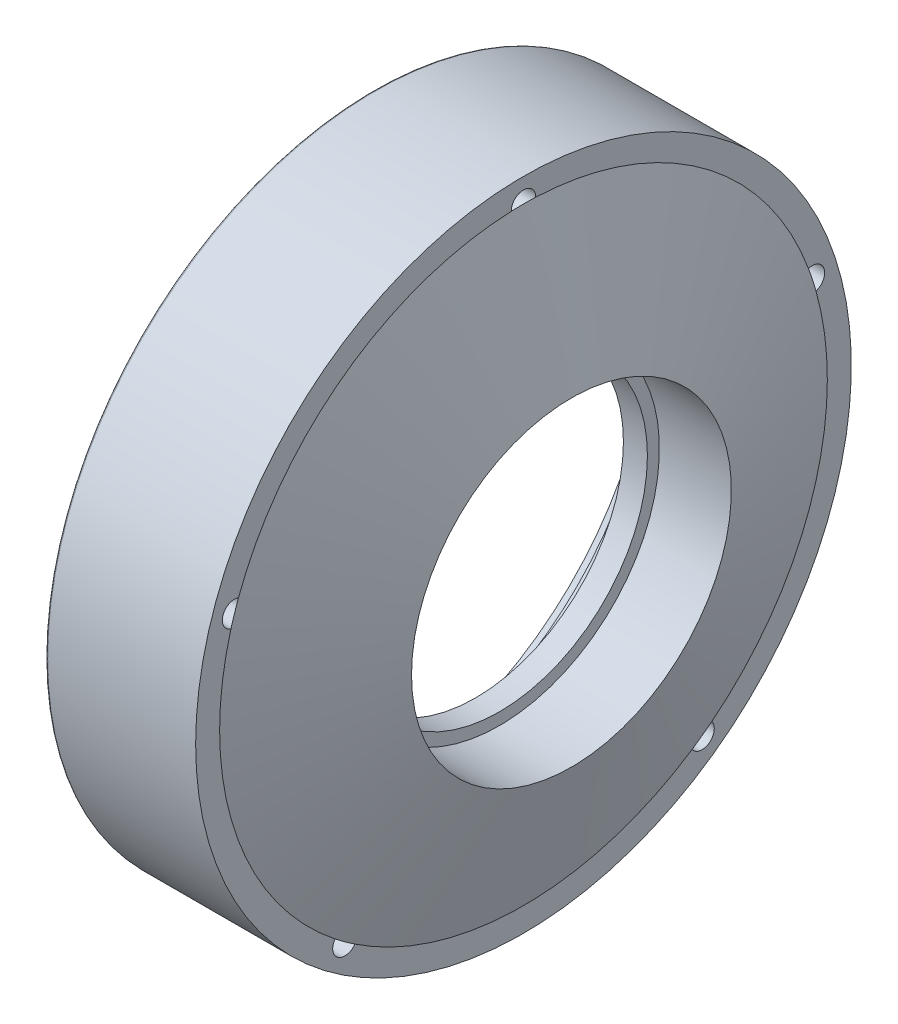
ISO-10303-21;
HEADER;
FILE_DESCRIPTION(('STEP AP214'),'2;1');
FILE_NAME('part.step','',(''),(''),'','','');
FILE_SCHEMA(('AUTOMOTIVE_DESIGN { 1 0 10303 214 1 1 1 1 }'));
ENDSEC;
DATA;
#1=APPLICATION_CONTEXT('core data for automotive mechanical design processes');
#2=APPLICATION_PROTOCOL_DEFINITION('international standard','automotive_design',2000,#1);
#3=PRODUCT_CONTEXT('',#1,'mechanical');
#4=PRODUCT('Part','Part','',(#3));
#5=PRODUCT_RELATED_PRODUCT_CATEGORY('part','',(#4));
#6=PRODUCT_DEFINITION_FORMATION('','',#4);
#7=PRODUCT_DEFINITION_CONTEXT('part definition',#1,'design');
#8=PRODUCT_DEFINITION('design','',#6,#7);
#9=PRODUCT_DEFINITION_SHAPE('','',#8);
#10=(LENGTH_UNIT() NAMED_UNIT(*) SI_UNIT(.MILLI.,.METRE.));
#11=(NAMED_UNIT(*) PLANE_ANGLE_UNIT() SI_UNIT($,.RADIAN.));
#12=(NAMED_UNIT(*) SI_UNIT($,.STERADIAN.) SOLID_ANGLE_UNIT());
#13=UNCERTAINTY_MEASURE_WITH_UNIT(LENGTH_MEASURE(1.E-05),#10,'distance_accuracy_value','');
#14=(GEOMETRIC_REPRESENTATION_CONTEXT(3) GLOBAL_UNCERTAINTY_ASSIGNED_CONTEXT((#13)) GLOBAL_UNIT_ASSIGNED_CONTEXT((#10,
#11,#12)) REPRESENTATION_CONTEXT('',''));
#15=CARTESIAN_POINT('',(0.,0.,0.));
#16=DIRECTION('',(0.,0.,1.));
#17=DIRECTION('',(1.,0.,0.));
#18=AXIS2_PLACEMENT_3D('',#15,#16,#17);
#19=CARTESIAN_POINT('',(74.9977297350531,0.,0.));
#20=DIRECTION('',(-1.,0.,0.));
#21=DIRECTION('',(0.,0.,1.));
#22=AXIS2_PLACEMENT_3D('',#19,#20,#21);
#23=CONICAL_SURFACE('',#22,152.,1.24913090974961);
#24=CARTESIAN_POINT('',(98.9909189402127,0.,0.));
#25=DIRECTION('',(-1.,0.,0.));
#26=DIRECTION('',(0.,0.,1.));
#27=AXIS2_PLACEMENT_3D('',#24,#25,#26);
#28=CIRCLE('',#27,80.);
#29=CARTESIAN_POINT('',(98.9909189402127,0.,80.));
#30=VERTEX_POINT('',#29);
#31=EDGE_CURVE('E245',#30,#30,#28,.T.);
#32=ORIENTED_EDGE('',*,*,#31,.T.);
#33=EDGE_LOOP('',(#32));
#34=FACE_BOUND('',#33,.T.);
#35=CARTESIAN_POINT('',(74.9977297350531,0.,0.));
#36=DIRECTION('',(-1.,0.,0.));
#37=DIRECTION('',(0.,0.,1.));
#38=AXIS2_PLACEMENT_3D('',#35,#36,#37);
#39=CIRCLE('',#38,152.);
#40=CARTESIAN_POINT('',(74.9977297350531,151.877598684211,6.09877183684493));
#41=VERTEX_POINT('',#40);
#42=CARTESIAN_POINT('',(74.9977297350531,151.877598684211,-6.09877183684496));
#43=VERTEX_POINT('',#42);
#44=EDGE_CURVE('E106',#41,#43,#39,.T.);
#45=ORIENTED_EDGE('',*,*,#44,.F.);
#46=CARTESIAN_POINT('',(74.9977297350531,52.7330357551096,142.559555765478));
#47=VERTEX_POINT('',#46);
#48=EDGE_CURVE('E96',#47,#41,#39,.T.);
#49=ORIENTED_EDGE('',*,*,#48,.F.);
#50=CARTESIAN_POINT('',(74.9977297350531,41.1324823614521,146.328804050279));
#51=VERTEX_POINT('',#50);
#52=EDGE_CURVE('E89',#51,#47,#39,.T.);
#53=ORIENTED_EDGE('',*,*,#52,.F.);
#54=CARTESIAN_POINT('',(74.9977297350531,-119.28679025759,94.2054227209976));
#55=VERTEX_POINT('',#54);
#56=EDGE_CURVE('E95',#55,#51,#39,.T.);
#57=ORIENTED_EDGE('',*,*,#56,.F.);
#58=CARTESIAN_POINT('',(74.9977297350531,-126.456326543178,84.3374025993519));
#59=VERTEX_POINT('',#58);
#60=EDGE_CURVE('E104',#59,#55,#39,.T.);
#61=ORIENTED_EDGE('',*,*,#60,.F.);
#62=CARTESIAN_POINT('',(74.9977297350533,-126.456326543179,-84.3374025993501));
#63=VERTEX_POINT('',#62);
#64=EDGE_CURVE('E105',#63,#59,#39,.T.);
#65=ORIENTED_EDGE('',*,*,#64,.F.);
#66=CARTESIAN_POINT('',(74.9977297350533,-119.286790257591,-94.2054227209959));
#67=VERTEX_POINT('',#66);
#68=EDGE_CURVE('E227',#67,#63,#39,.T.);
#69=ORIENTED_EDGE('',*,*,#68,.F.);
#70=CARTESIAN_POINT('',(74.9977297350533,41.13248236145,-146.328804050279));
#71=VERTEX_POINT('',#70);
#72=EDGE_CURVE('E217',#71,#67,#39,.T.);
#73=ORIENTED_EDGE('',*,*,#72,.F.);
#74=CARTESIAN_POINT('',(74.9977297350533,52.7330357551075,-142.559555765478));
#75=VERTEX_POINT('',#74);
#76=EDGE_CURVE('E212',#75,#71,#39,.T.);
#77=ORIENTED_EDGE('',*,*,#76,.F.);
#78=EDGE_CURVE('E109',#43,#75,#39,.T.);
#79=ORIENTED_EDGE('',*,*,#78,.F.);
#80=EDGE_LOOP('',(#45,#49,#53,#57,#61,#65,#69,#73,#77,#79));
#81=FACE_BOUND('',#80,.T.);
#82=ADVANCED_FACE('F34',(#34,#81),#23,.T.);
#83=CARTESIAN_POINT('',(74.9977297350531,0.,0.));
#84=DIRECTION('',(1.,0.,0.));
#85=DIRECTION('',(0.,0.,-1.));
#86=AXIS2_PLACEMENT_3D('',#83,#84,#85);
#87=PLANE('',#86);
#88=CARTESIAN_POINT('',(74.9977297350533,46.9705831449916,-144.560590476864));
#89=DIRECTION('',(1.,0.,0.));
#90=DIRECTION('',(0.,-0.951056516295155,-0.309016994374945));
#91=AXIS2_PLACEMENT_3D('',#88,#89,#90);
#92=CIRCLE('',#91,6.1);
#93=EDGE_CURVE('E219',#71,#75,#92,.T.);
#94=ORIENTED_EDGE('',*,*,#93,.F.);
#95=ORIENTED_EDGE('',*,*,#72,.T.);
#96=CARTESIAN_POINT('',(74.9977297350533,-122.970583144993,-89.3433583484552));
#97=DIRECTION('',(1.,0.,0.));
#98=DIRECTION('',(0.,-0.587785252292468,0.809016994374951));
#99=AXIS2_PLACEMENT_3D('',#96,#97,#98);
#100=CIRCLE('',#99,6.1);
#101=EDGE_CURVE('E229',#63,#67,#100,.T.);
#102=ORIENTED_EDGE('',*,*,#101,.F.);
#103=ORIENTED_EDGE('',*,*,#64,.T.);
#104=CARTESIAN_POINT('',(74.9977297350531,-122.970583144991,89.343358348457));
#105=DIRECTION('',(1.,0.,0.));
#106=DIRECTION('',(0.,0.58778525229248,0.809016994374942));
#107=AXIS2_PLACEMENT_3D('',#104,#105,#106);
#108=CIRCLE('',#107,6.1);
#109=EDGE_CURVE('E103',#55,#59,#108,.T.);
#110=ORIENTED_EDGE('',*,*,#109,.F.);
#111=ORIENTED_EDGE('',*,*,#56,.T.);
#112=CARTESIAN_POINT('',(74.9977297350531,46.9705831449937,144.560590476863));
#113=DIRECTION('',(1.,0.,0.));
#114=DIRECTION('',(0.,0.95105651629515,-0.309016994374958));
#115=AXIS2_PLACEMENT_3D('',#112,#113,#114);
#116=CIRCLE('',#115,6.1);
#117=EDGE_CURVE('E79',#47,#51,#116,.T.);
#118=ORIENTED_EDGE('',*,*,#117,.F.);
#119=ORIENTED_EDGE('',*,*,#48,.T.);
#120=CARTESIAN_POINT('',(74.9977297350531,152.,0.));
#121=DIRECTION('',(1.,0.,0.));
#122=DIRECTION('',(0.,0.,-1.));
#123=AXIS2_PLACEMENT_3D('',#120,#121,#122);
#124=CIRCLE('',#123,6.1);
#125=EDGE_CURVE('E242',#43,#41,#124,.T.);
#126=ORIENTED_EDGE('',*,*,#125,.F.);
#127=ORIENTED_EDGE('',*,*,#78,.T.);
#128=EDGE_LOOP('',(#94,#95,#102,#103,#110,#111,#118,#119,#126,#127));
#129=FACE_BOUND('',#128,.T.);
#130=CARTESIAN_POINT('',(74.9977297350531,0.,0.));
#131=DIRECTION('',(-1.,0.,0.));
#132=DIRECTION('',(0.,0.,1.));
#133=AXIS2_PLACEMENT_3D('',#130,#131,#132);
#134=CIRCLE('',#133,164.);
#135=CARTESIAN_POINT('',(74.9977297350531,0.,164.));
#136=VERTEX_POINT('',#135);
#137=EDGE_CURVE('E110',#136,#136,#134,.T.);
#138=ORIENTED_EDGE('',*,*,#137,.F.);
#139=EDGE_LOOP('',(#138));
#140=FACE_BOUND('',#139,.T.);
#141=ADVANCED_FACE('F100',(#129,#140),#87,.T.);
#142=CARTESIAN_POINT('',(0.,0.,0.));
#143=DIRECTION('',(-1.,0.,0.));
#144=DIRECTION('',(0.,0.,1.));
#145=AXIS2_PLACEMENT_3D('',#142,#143,#144);
#146=CYLINDRICAL_SURFACE('',#145,164.);
#147=CARTESIAN_POINT('',(1.,0.,0.));
#148=DIRECTION('',(-1.,0.,0.));
#149=DIRECTION('',(0.,0.,1.));
#150=AXIS2_PLACEMENT_3D('',#147,#148,#149);
#151=CIRCLE('',#150,164.);
#152=CARTESIAN_POINT('',(1.,0.,164.));
#153=VERTEX_POINT('',#152);
#154=EDGE_CURVE('E11',#153,#153,#151,.F.);
#155=ORIENTED_EDGE('',*,*,#154,.T.);
#156=EDGE_LOOP('',(#155));
#157=FACE_BOUND('',#156,.T.);
#158=ORIENTED_EDGE('',*,*,#137,.T.);
#159=EDGE_LOOP('',(#158));
#160=FACE_BOUND('',#159,.T.);
#161=ADVANCED_FACE('F133',(#157,#160),#146,.T.);
#162=CARTESIAN_POINT('',(0.,0.,0.));
#163=DIRECTION('',(-1.,0.,0.));
#164=DIRECTION('',(0.,0.,1.));
#165=AXIS2_PLACEMENT_3D('',#162,#163,#164);
#166=PLANE('',#165);
#167=CARTESIAN_POINT('',(0.,0.,0.));
#168=DIRECTION('',(-1.,0.,0.));
#169=DIRECTION('',(0.,0.,1.));
#170=AXIS2_PLACEMENT_3D('',#167,#168,#169);
#171=CIRCLE('',#170,163.);
#172=CARTESIAN_POINT('',(0.,0.,163.));
#173=VERTEX_POINT('',#172);
#174=EDGE_CURVE('E42',#173,#173,#171,.T.);
#175=ORIENTED_EDGE('',*,*,#174,.T.);
#176=EDGE_LOOP('',(#175));
#177=FACE_BOUND('',#176,.T.);
#178=CARTESIAN_POINT('',(0.,46.9705831449916,-144.560590476864));
#179=DIRECTION('',(-1.,0.,0.));
#180=DIRECTION('',(0.,0.,1.));
#181=AXIS2_PLACEMENT_3D('',#178,#179,#180);
#182=CIRCLE('',#181,6.1);
#183=CARTESIAN_POINT('',(0.,46.9705831449916,-138.460590476864));
#184=VERTEX_POINT('',#183);
#185=EDGE_CURVE('E279',#184,#184,#182,.F.);
#186=ORIENTED_EDGE('',*,*,#185,.T.);
#187=EDGE_LOOP('',(#186));
#188=FACE_BOUND('',#187,.T.);
#189=CARTESIAN_POINT('',(0.,-122.970583144993,-89.3433583484552));
#190=DIRECTION('',(-1.,0.,0.));
#191=DIRECTION('',(0.,0.,1.));
#192=AXIS2_PLACEMENT_3D('',#189,#190,#191);
#193=CIRCLE('',#192,6.1);
#194=CARTESIAN_POINT('',(0.,-122.970583144993,-83.2433583484552));
#195=VERTEX_POINT('',#194);
#196=EDGE_CURVE('E222',#195,#195,#193,.F.);
#197=ORIENTED_EDGE('',*,*,#196,.T.);
#198=EDGE_LOOP('',(#197));
#199=FACE_BOUND('',#198,.T.);
#200=CARTESIAN_POINT('',(0.,-122.970583144991,89.343358348457));
#201=DIRECTION('',(-1.,0.,0.));
#202=DIRECTION('',(0.,0.,1.));
#203=AXIS2_PLACEMENT_3D('',#200,#201,#202);
#204=CIRCLE('',#203,6.1);
#205=CARTESIAN_POINT('',(0.,-122.970583144991,95.443358348457));
#206=VERTEX_POINT('',#205);
#207=EDGE_CURVE('E230',#206,#206,#204,.F.);
#208=ORIENTED_EDGE('',*,*,#207,.T.);
#209=EDGE_LOOP('',(#208));
#210=FACE_BOUND('',#209,.T.);
#211=CARTESIAN_POINT('',(0.,46.9705831449937,144.560590476863));
#212=DIRECTION('',(-1.,0.,0.));
#213=DIRECTION('',(0.,0.,1.));
#214=AXIS2_PLACEMENT_3D('',#211,#212,#213);
#215=CIRCLE('',#214,6.1);
#216=CARTESIAN_POINT('',(0.,46.9705831449937,150.660590476863));
#217=VERTEX_POINT('',#216);
#218=EDGE_CURVE('E90',#217,#217,#215,.F.);
#219=ORIENTED_EDGE('',*,*,#218,.T.);
#220=EDGE_LOOP('',(#219));
#221=FACE_BOUND('',#220,.T.);
#222=CARTESIAN_POINT('',(0.,152.,0.));
#223=DIRECTION('',(-1.,0.,0.));
#224=DIRECTION('',(0.,0.,1.));
#225=AXIS2_PLACEMENT_3D('',#222,#223,#224);
#226=CIRCLE('',#225,6.1);
#227=CARTESIAN_POINT('',(0.,152.,6.09999999999999));
#228=VERTEX_POINT('',#227);
#229=EDGE_CURVE('E241',#228,#228,#226,.F.);
#230=ORIENTED_EDGE('',*,*,#229,.T.);
#231=EDGE_LOOP('',(#230));
#232=FACE_BOUND('',#231,.T.);
#233=CARTESIAN_POINT('',(0.,0.,0.));
#234=DIRECTION('',(-1.,0.,0.));
#235=DIRECTION('',(0.,0.,1.));
#236=AXIS2_PLACEMENT_3D('',#233,#234,#235);
#237=CIRCLE('',#236,140.);
#238=CARTESIAN_POINT('',(0.,0.,140.));
#239=VERTEX_POINT('',#238);
#240=EDGE_CURVE('E270',#239,#239,#237,.T.);
#241=ORIENTED_EDGE('',*,*,#240,.F.);
#242=EDGE_LOOP('',(#241));
#243=FACE_BOUND('',#242,.T.);
#244=ADVANCED_FACE('F115',(#177,#188,#199,#210,#221,#232,#243),#166,.T.);
#245=CARTESIAN_POINT('',(0.,0.,0.));
#246=DIRECTION('',(-1.,0.,0.));
#247=DIRECTION('',(0.,0.,1.));
#248=AXIS2_PLACEMENT_3D('',#245,#246,#247);
#249=CYLINDRICAL_SURFACE('',#248,140.);
#250=ORIENTED_EDGE('',*,*,#240,.T.);
#251=EDGE_LOOP('',(#250));
#252=FACE_BOUND('',#251,.T.);
#253=CARTESIAN_POINT('',(10.,0.,0.));
#254=DIRECTION('',(-1.,0.,0.));
#255=DIRECTION('',(0.,0.,1.));
#256=AXIS2_PLACEMENT_3D('',#253,#254,#255);
#257=CIRCLE('',#256,140.);
#258=CARTESIAN_POINT('',(10.,0.,140.));
#259=VERTEX_POINT('',#258);
#260=EDGE_CURVE('E268',#259,#259,#257,.T.);
#261=ORIENTED_EDGE('',*,*,#260,.F.);
#262=EDGE_LOOP('',(#261));
#263=FACE_BOUND('',#262,.T.);
#264=ADVANCED_FACE('F142',(#252,#263),#249,.F.);
#265=CARTESIAN_POINT('',(10.,0.,0.));
#266=DIRECTION('',(-1.,0.,0.));
#267=DIRECTION('',(0.,0.,1.));
#268=AXIS2_PLACEMENT_3D('',#265,#266,#267);
#269=PLANE('',#268);
#270=ORIENTED_EDGE('',*,*,#260,.T.);
#271=EDGE_LOOP('',(#270));
#272=FACE_BOUND('',#271,.T.);
#273=CARTESIAN_POINT('',(10.,0.,0.));
#274=DIRECTION('',(-1.,0.,0.));
#275=DIRECTION('',(0.,0.,1.));
#276=AXIS2_PLACEMENT_3D('',#273,#274,#275);
#277=CIRCLE('',#276,130.);
#278=CARTESIAN_POINT('',(10.,0.,130.));
#279=VERTEX_POINT('',#278);
#280=EDGE_CURVE('E265',#279,#279,#277,.T.);
#281=ORIENTED_EDGE('',*,*,#280,.F.);
#282=EDGE_LOOP('',(#281));
#283=FACE_BOUND('',#282,.T.);
#284=ADVANCED_FACE('F145',(#272,#283),#269,.T.);
#285=CARTESIAN_POINT('',(0.,0.,0.));
#286=DIRECTION('',(-1.,0.,0.));
#287=DIRECTION('',(0.,0.,1.));
#288=AXIS2_PLACEMENT_3D('',#285,#286,#287);
#289=CYLINDRICAL_SURFACE('',#288,130.);
#290=ORIENTED_EDGE('',*,*,#280,.T.);
#291=EDGE_LOOP('',(#290));
#292=FACE_BOUND('',#291,.T.);
#293=CARTESIAN_POINT('',(43.,0.,0.));
#294=DIRECTION('',(-1.,0.,0.));
#295=DIRECTION('',(0.,0.,1.));
#296=AXIS2_PLACEMENT_3D('',#293,#294,#295);
#297=CIRCLE('',#296,130.);
#298=CARTESIAN_POINT('',(43.,0.,130.));
#299=VERTEX_POINT('',#298);
#300=EDGE_CURVE('E262',#299,#299,#297,.T.);
#301=ORIENTED_EDGE('',*,*,#300,.F.);
#302=EDGE_LOOP('',(#301));
#303=FACE_BOUND('',#302,.T.);
#304=ADVANCED_FACE('F149',(#292,#303),#289,.F.);
#305=CARTESIAN_POINT('',(43.,0.,0.));
#306=DIRECTION('',(1.,0.,0.));
#307=DIRECTION('',(0.,0.,-1.));
#308=AXIS2_PLACEMENT_3D('',#305,#306,#307);
#309=PLANE('',#308);
#310=CARTESIAN_POINT('',(43.,0.,0.));
#311=DIRECTION('',(-1.,0.,0.));
#312=DIRECTION('',(0.,0.,1.));
#313=AXIS2_PLACEMENT_3D('',#310,#311,#312);
#314=CIRCLE('',#313,108.);
#315=CARTESIAN_POINT('',(43.,0.,108.));
#316=VERTEX_POINT('',#315);
#317=EDGE_CURVE('E259',#316,#316,#314,.T.);
#318=ORIENTED_EDGE('',*,*,#317,.F.);
#319=EDGE_LOOP('',(#318));
#320=FACE_BOUND('',#319,.T.);
#321=ORIENTED_EDGE('',*,*,#300,.T.);
#322=EDGE_LOOP('',(#321));
#323=FACE_BOUND('',#322,.T.);
#324=ADVANCED_FACE('F153',(#320,#323),#309,.F.);
#325=CARTESIAN_POINT('',(50.9977297350532,0.,0.));
#326=DIRECTION('',(-1.,0.,0.));
#327=DIRECTION('',(0.,0.,1.));
#328=AXIS2_PLACEMENT_3D('',#325,#326,#327);
#329=CONICAL_SURFACE('',#328,84.,1.24913090974961);
#330=ORIENTED_EDGE('',*,*,#317,.T.);
#331=EDGE_LOOP('',(#330));
#332=FACE_BOUND('',#331,.T.);
#333=CARTESIAN_POINT('',(50.9977297350532,0.,0.));
#334=DIRECTION('',(-1.,0.,0.));
#335=DIRECTION('',(0.,0.,1.));
#336=AXIS2_PLACEMENT_3D('',#333,#334,#335);
#337=CIRCLE('',#336,84.);
#338=CARTESIAN_POINT('',(50.9977297350532,0.,84.));
#339=VERTEX_POINT('',#338);
#340=EDGE_CURVE('E256',#339,#339,#337,.T.);
#341=ORIENTED_EDGE('',*,*,#340,.F.);
#342=EDGE_LOOP('',(#341));
#343=FACE_BOUND('',#342,.T.);
#344=ADVANCED_FACE('F157',(#332,#343),#329,.F.);
#345=CARTESIAN_POINT('',(50.9977297350532,0.,0.));
#346=DIRECTION('',(-1.,0.,0.));
#347=DIRECTION('',(0.,0.,1.));
#348=AXIS2_PLACEMENT_3D('',#345,#346,#347);
#349=PLANE('',#348);
#350=ORIENTED_EDGE('',*,*,#340,.T.);
#351=EDGE_LOOP('',(#350));
#352=FACE_BOUND('',#351,.T.);
#353=CARTESIAN_POINT('',(50.9977297350532,0.,0.));
#354=DIRECTION('',(-1.,0.,0.));
#355=DIRECTION('',(0.,0.,1.));
#356=AXIS2_PLACEMENT_3D('',#353,#354,#355);
#357=CIRCLE('',#356,74.);
#358=CARTESIAN_POINT('',(50.9977297350532,0.,74.));
#359=VERTEX_POINT('',#358);
#360=EDGE_CURVE('E253',#359,#359,#357,.T.);
#361=ORIENTED_EDGE('',*,*,#360,.F.);
#362=EDGE_LOOP('',(#361));
#363=FACE_BOUND('',#362,.T.);
#364=ADVANCED_FACE('F161',(#352,#363),#349,.T.);
#365=CARTESIAN_POINT('',(0.,0.,0.));
#366=DIRECTION('',(-1.,0.,0.));
#367=DIRECTION('',(0.,0.,1.));
#368=AXIS2_PLACEMENT_3D('',#365,#366,#367);
#369=CYLINDRICAL_SURFACE('',#368,74.);
#370=ORIENTED_EDGE('',*,*,#360,.T.);
#371=EDGE_LOOP('',(#370));
#372=FACE_BOUND('',#371,.T.);
#373=CARTESIAN_POINT('',(62.9977297350532,0.,0.));
#374=DIRECTION('',(-1.,0.,0.));
#375=DIRECTION('',(0.,0.,1.));
#376=AXIS2_PLACEMENT_3D('',#373,#374,#375);
#377=CIRCLE('',#376,74.);
#378=CARTESIAN_POINT('',(62.9977297350532,0.,74.));
#379=VERTEX_POINT('',#378);
#380=EDGE_CURVE('E250',#379,#379,#377,.T.);
#381=ORIENTED_EDGE('',*,*,#380,.F.);
#382=EDGE_LOOP('',(#381));
#383=FACE_BOUND('',#382,.T.);
#384=ADVANCED_FACE('F165',(#372,#383),#369,.F.);
#385=CARTESIAN_POINT('',(62.9977297350532,0.,0.));
#386=DIRECTION('',(1.,0.,0.));
#387=DIRECTION('',(0.,0.,-1.));
#388=AXIS2_PLACEMENT_3D('',#385,#386,#387);
#389=PLANE('',#388);
#390=ORIENTED_EDGE('',*,*,#380,.T.);
#391=EDGE_LOOP('',(#390));
#392=FACE_BOUND('',#391,.T.);
#393=CARTESIAN_POINT('',(62.9977297350532,0.,0.));
#394=DIRECTION('',(-1.,0.,0.));
#395=DIRECTION('',(0.,0.,1.));
#396=AXIS2_PLACEMENT_3D('',#393,#394,#395);
#397=CIRCLE('',#396,80.);
#398=CARTESIAN_POINT('',(62.9977297350532,0.,80.));
#399=VERTEX_POINT('',#398);
#400=EDGE_CURVE('E247',#399,#399,#397,.T.);
#401=ORIENTED_EDGE('',*,*,#400,.F.);
#402=EDGE_LOOP('',(#401));
#403=FACE_BOUND('',#402,.T.);
#404=ADVANCED_FACE('F169',(#392,#403),#389,.T.);
#405=CARTESIAN_POINT('',(0.,0.,0.));
#406=DIRECTION('',(-1.,0.,0.));
#407=DIRECTION('',(0.,0.,1.));
#408=AXIS2_PLACEMENT_3D('',#405,#406,#407);
#409=CYLINDRICAL_SURFACE('',#408,80.);
#410=ORIENTED_EDGE('',*,*,#31,.F.);
#411=EDGE_LOOP('',(#410));
#412=FACE_BOUND('',#411,.T.);
#413=ORIENTED_EDGE('',*,*,#400,.T.);
#414=EDGE_LOOP('',(#413));
#415=FACE_BOUND('',#414,.T.);
#416=ADVANCED_FACE('F173',(#412,#415),#409,.F.);
#417=CARTESIAN_POINT('',(74.9977297350531,152.,0.));
#418=DIRECTION('',(1.,0.,0.));
#419=DIRECTION('',(0.,0.,-1.));
#420=AXIS2_PLACEMENT_3D('',#417,#418,#419);
#421=PLANE('',#420);
#422=ORIENTED_EDGE('',*,*,#44,.T.);
#423=EDGE_CURVE('E239',#41,#43,#124,.T.);
#424=ORIENTED_EDGE('',*,*,#423,.F.);
#425=EDGE_LOOP('',(#422,#424));
#426=FACE_BOUND('',#425,.T.);
#427=ADVANCED_FACE('F177',(#426),#421,.F.);
#428=CARTESIAN_POINT('',(-17.2534054609518,152.,0.));
#429=DIRECTION('',(1.,0.,0.));
#430=DIRECTION('',(0.,0.,-1.));
#431=AXIS2_PLACEMENT_3D('',#428,#429,#430);
#432=CYLINDRICAL_SURFACE('',#431,6.1);
#433=ORIENTED_EDGE('',*,*,#423,.T.);
#434=ORIENTED_EDGE('',*,*,#125,.T.);
#435=EDGE_LOOP('',(#433,#434));
#436=FACE_BOUND('',#435,.T.);
#437=ORIENTED_EDGE('',*,*,#229,.F.);
#438=EDGE_LOOP('',(#437));
#439=FACE_BOUND('',#438,.T.);
#440=ADVANCED_FACE('F179',(#436,#439),#432,.F.);
#441=CARTESIAN_POINT('',(74.9977297350531,46.9705831449937,144.560590476863));
#442=DIRECTION('',(1.,0.,0.));
#443=DIRECTION('',(0.,0.95105651629515,-0.309016994374958));
#444=AXIS2_PLACEMENT_3D('',#441,#442,#443);
#445=PLANE('',#444);
#446=ORIENTED_EDGE('',*,*,#52,.T.);
#447=EDGE_CURVE('E48',#51,#47,#116,.T.);
#448=ORIENTED_EDGE('',*,*,#447,.F.);
#449=EDGE_LOOP('',(#446,#448));
#450=FACE_BOUND('',#449,.T.);
#451=ADVANCED_FACE('F88',(#450),#445,.F.);
#452=CARTESIAN_POINT('',(-17.2534054609518,46.9705831449937,144.560590476863));
#453=DIRECTION('',(1.,0.,0.));
#454=DIRECTION('',(0.,0.,-1.));
#455=AXIS2_PLACEMENT_3D('',#452,#453,#454);
#456=CYLINDRICAL_SURFACE('',#455,6.1);
#457=ORIENTED_EDGE('',*,*,#447,.T.);
#458=ORIENTED_EDGE('',*,*,#117,.T.);
#459=EDGE_LOOP('',(#457,#458));
#460=FACE_BOUND('',#459,.T.);
#461=ORIENTED_EDGE('',*,*,#218,.F.);
#462=EDGE_LOOP('',(#461));
#463=FACE_BOUND('',#462,.T.);
#464=ADVANCED_FACE('F80',(#460,#463),#456,.F.);
#465=CARTESIAN_POINT('',(74.9977297350531,-122.970583144991,89.343358348457));
#466=DIRECTION('',(1.,0.,0.));
#467=DIRECTION('',(0.,0.58778525229248,0.809016994374942));
#468=AXIS2_PLACEMENT_3D('',#465,#466,#467);
#469=PLANE('',#468);
#470=ORIENTED_EDGE('',*,*,#60,.T.);
#471=EDGE_CURVE('E55',#59,#55,#108,.T.);
#472=ORIENTED_EDGE('',*,*,#471,.F.);
#473=EDGE_LOOP('',(#470,#472));
#474=FACE_BOUND('',#473,.T.);
#475=ADVANCED_FACE('F188',(#474),#469,.F.);
#476=CARTESIAN_POINT('',(-17.2534054609518,-122.970583144991,89.343358348457));
#477=DIRECTION('',(1.,0.,0.));
#478=DIRECTION('',(0.,0.,-1.));
#479=AXIS2_PLACEMENT_3D('',#476,#477,#478);
#480=CYLINDRICAL_SURFACE('',#479,6.1);
#481=ORIENTED_EDGE('',*,*,#471,.T.);
#482=ORIENTED_EDGE('',*,*,#109,.T.);
#483=EDGE_LOOP('',(#481,#482));
#484=FACE_BOUND('',#483,.T.);
#485=ORIENTED_EDGE('',*,*,#207,.F.);
#486=EDGE_LOOP('',(#485));
#487=FACE_BOUND('',#486,.T.);
#488=ADVANCED_FACE('F191',(#484,#487),#480,.F.);
#489=CARTESIAN_POINT('',(74.9977297350533,-122.970583144993,-89.3433583484552));
#490=DIRECTION('',(1.,0.,0.));
#491=DIRECTION('',(0.,-0.587785252292468,0.809016994374951));
#492=AXIS2_PLACEMENT_3D('',#489,#490,#491);
#493=PLANE('',#492);
#494=ORIENTED_EDGE('',*,*,#68,.T.);
#495=EDGE_CURVE('E283',#67,#63,#100,.T.);
#496=ORIENTED_EDGE('',*,*,#495,.F.);
#497=EDGE_LOOP('',(#494,#496));
#498=FACE_BOUND('',#497,.T.);
#499=ADVANCED_FACE('F194',(#498),#493,.F.);
#500=CARTESIAN_POINT('',(-17.2534054609518,-122.970583144993,-89.3433583484552));
#501=DIRECTION('',(1.,0.,0.));
#502=DIRECTION('',(0.,0.,-1.));
#503=AXIS2_PLACEMENT_3D('',#500,#501,#502);
#504=CYLINDRICAL_SURFACE('',#503,6.1);
#505=ORIENTED_EDGE('',*,*,#495,.T.);
#506=ORIENTED_EDGE('',*,*,#101,.T.);
#507=EDGE_LOOP('',(#505,#506));
#508=FACE_BOUND('',#507,.T.);
#509=ORIENTED_EDGE('',*,*,#196,.F.);
#510=EDGE_LOOP('',(#509));
#511=FACE_BOUND('',#510,.T.);
#512=ADVANCED_FACE('F198',(#508,#511),#504,.F.);
#513=CARTESIAN_POINT('',(74.9977297350533,46.9705831449916,-144.560590476864));
#514=DIRECTION('',(1.,0.,0.));
#515=DIRECTION('',(0.,-0.951056516295155,-0.309016994374945));
#516=AXIS2_PLACEMENT_3D('',#513,#514,#515);
#517=PLANE('',#516);
#518=ORIENTED_EDGE('',*,*,#76,.T.);
#519=EDGE_CURVE('E213',#75,#71,#92,.T.);
#520=ORIENTED_EDGE('',*,*,#519,.F.);
#521=EDGE_LOOP('',(#518,#520));
#522=FACE_BOUND('',#521,.T.);
#523=ADVANCED_FACE('F124',(#522),#517,.F.);
#524=CARTESIAN_POINT('',(-17.2534054609518,46.9705831449916,-144.560590476864));
#525=DIRECTION('',(1.,0.,0.));
#526=DIRECTION('',(0.,0.,-1.));
#527=AXIS2_PLACEMENT_3D('',#524,#525,#526);
#528=CYLINDRICAL_SURFACE('',#527,6.1);
#529=ORIENTED_EDGE('',*,*,#519,.T.);
#530=ORIENTED_EDGE('',*,*,#93,.T.);
#531=EDGE_LOOP('',(#529,#530));
#532=FACE_BOUND('',#531,.T.);
#533=ORIENTED_EDGE('',*,*,#185,.F.);
#534=EDGE_LOOP('',(#533));
#535=FACE_BOUND('',#534,.T.);
#536=ADVANCED_FACE('F119',(#532,#535),#528,.F.);
#537=CARTESIAN_POINT('',(1.,0.,0.));
#538=DIRECTION('',(-1.,0.,0.));
#539=DIRECTION('',(0.,0.,1.));
#540=AXIS2_PLACEMENT_3D('',#537,#538,#539);
#541=TOROIDAL_SURFACE('',#540,163.,1.);
#542=ORIENTED_EDGE('',*,*,#154,.F.);
#543=EDGE_LOOP('',(#542));
#544=FACE_BOUND('',#543,.T.);
#545=ORIENTED_EDGE('',*,*,#174,.F.);
#546=EDGE_LOOP('',(#545));
#547=FACE_BOUND('',#546,.T.);
#548=ADVANCED_FACE('F36',(#544,#547),#541,.T.);
#549=CLOSED_SHELL('',(#82,#141,#161,#244,#264,#284,#304,#324,#344,#364,#384,#404,#416,#427,#440,
#451,#464,#475,#488,#499,#512,#523,#536,#548));
#550=MANIFOLD_SOLID_BREP('B2',#549);
#551=ADVANCED_BREP_SHAPE_REPRESENTATION('',(#18,#550),#14);
#552=SHAPE_DEFINITION_REPRESENTATION(#9,#551);
ENDSEC;
END-ISO-10303-21;
